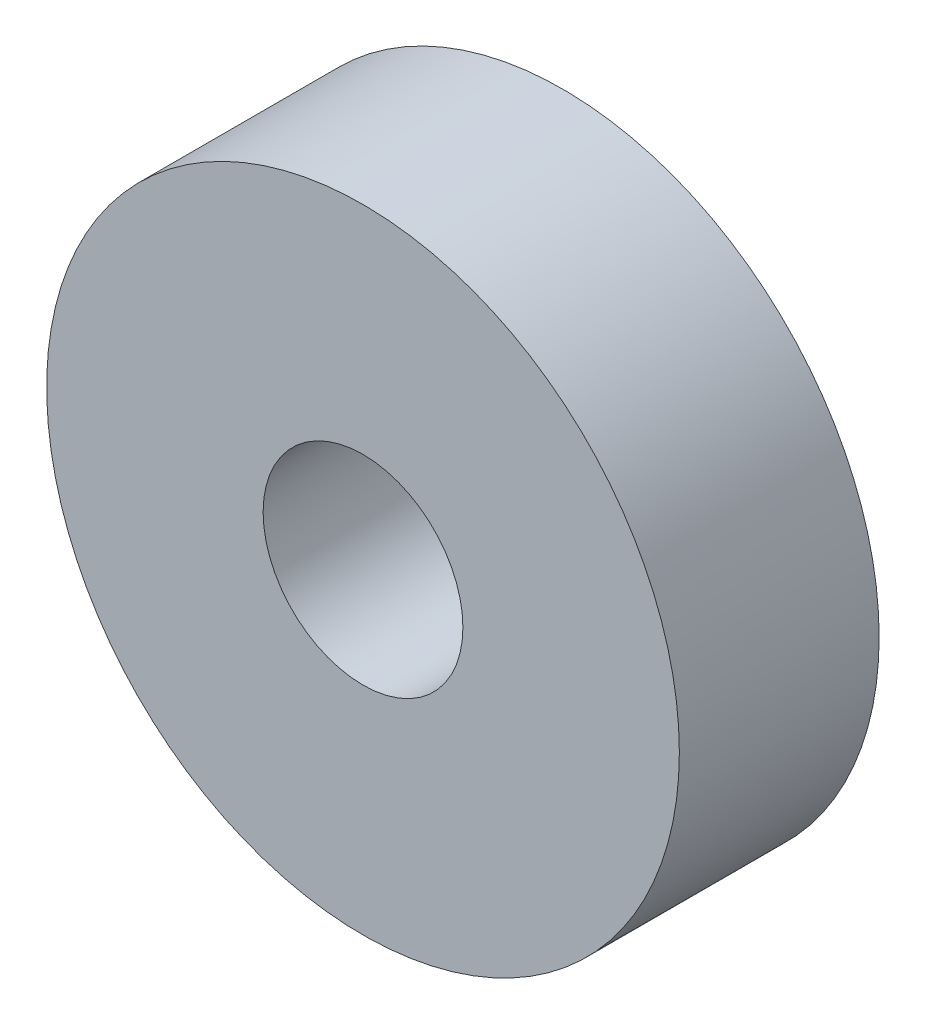
ISO-10303-21;
HEADER;
FILE_DESCRIPTION(('STEP AP214'),'2;1');
FILE_NAME('part.step','',(''),(''),'','','');
FILE_SCHEMA(('AUTOMOTIVE_DESIGN { 1 0 10303 214 1 1 1 1 }'));
ENDSEC;
DATA;
#1=APPLICATION_CONTEXT('core data for automotive mechanical design processes');
#2=APPLICATION_PROTOCOL_DEFINITION('international standard','automotive_design',2000,#1);
#3=PRODUCT_CONTEXT('',#1,'mechanical');
#4=PRODUCT('Part','Part','',(#3));
#5=PRODUCT_RELATED_PRODUCT_CATEGORY('part','',(#4));
#6=PRODUCT_DEFINITION_FORMATION('','',#4);
#7=PRODUCT_DEFINITION_CONTEXT('part definition',#1,'design');
#8=PRODUCT_DEFINITION('design','',#6,#7);
#9=PRODUCT_DEFINITION_SHAPE('','',#8);
#10=(LENGTH_UNIT() NAMED_UNIT(*) SI_UNIT(.MILLI.,.METRE.));
#11=(NAMED_UNIT(*) PLANE_ANGLE_UNIT() SI_UNIT($,.RADIAN.));
#12=(NAMED_UNIT(*) SI_UNIT($,.STERADIAN.) SOLID_ANGLE_UNIT());
#13=UNCERTAINTY_MEASURE_WITH_UNIT(LENGTH_MEASURE(1.E-05),#10,'distance_accuracy_value','');
#14=(GEOMETRIC_REPRESENTATION_CONTEXT(3) GLOBAL_UNCERTAINTY_ASSIGNED_CONTEXT((#13)) GLOBAL_UNIT_ASSIGNED_CONTEXT((#10,
#11,#12)) REPRESENTATION_CONTEXT('',''));
#15=CARTESIAN_POINT('',(0.,0.,0.));
#16=DIRECTION('',(0.,0.,1.));
#17=DIRECTION('',(1.,0.,0.));
#18=AXIS2_PLACEMENT_3D('',#15,#16,#17);
#19=CARTESIAN_POINT('',(0.,0.,6.));
#20=DIRECTION('',(0.,0.,1.));
#21=DIRECTION('',(1.,0.,0.));
#22=AXIS2_PLACEMENT_3D('',#19,#20,#21);
#23=PLANE('',#22);
#24=CARTESIAN_POINT('',(0.,0.,6.));
#25=DIRECTION('',(0.,0.,1.));
#26=DIRECTION('',(1.,0.,0.));
#27=AXIS2_PLACEMENT_3D('',#24,#25,#26);
#28=CIRCLE('',#27,9.5);
#29=CARTESIAN_POINT('',(9.5,0.,6.));
#30=VERTEX_POINT('',#29);
#31=EDGE_CURVE('E10',#30,#30,#28,.T.);
#32=ORIENTED_EDGE('',*,*,#31,.T.);
#33=EDGE_LOOP('',(#32));
#34=FACE_BOUND('',#33,.T.);
#35=CARTESIAN_POINT('',(0.,0.,6.));
#36=DIRECTION('',(0.,0.,1.));
#37=DIRECTION('',(1.,0.,0.));
#38=AXIS2_PLACEMENT_3D('',#35,#36,#37);
#39=CIRCLE('',#38,3.);
#40=CARTESIAN_POINT('',(3.,0.,6.));
#41=VERTEX_POINT('',#40);
#42=EDGE_CURVE('E39',#41,#41,#39,.T.);
#43=ORIENTED_EDGE('',*,*,#42,.F.);
#44=EDGE_LOOP('',(#43));
#45=FACE_BOUND('',#44,.T.);
#46=ADVANCED_FACE('F28',(#34,#45),#23,.T.);
#47=CARTESIAN_POINT('',(0.,0.,0.));
#48=DIRECTION('',(0.,0.,1.));
#49=DIRECTION('',(1.,0.,0.));
#50=AXIS2_PLACEMENT_3D('',#47,#48,#49);
#51=PLANE('',#50);
#52=CARTESIAN_POINT('',(0.,0.,0.));
#53=DIRECTION('',(0.,0.,1.));
#54=DIRECTION('',(1.,0.,0.));
#55=AXIS2_PLACEMENT_3D('',#52,#53,#54);
#56=CIRCLE('',#55,9.5);
#57=CARTESIAN_POINT('',(9.5,0.,0.));
#58=VERTEX_POINT('',#57);
#59=EDGE_CURVE('E32',#58,#58,#56,.T.);
#60=ORIENTED_EDGE('',*,*,#59,.F.);
#61=EDGE_LOOP('',(#60));
#62=FACE_BOUND('',#61,.T.);
#63=CARTESIAN_POINT('',(0.,0.,0.));
#64=DIRECTION('',(0.,0.,1.));
#65=DIRECTION('',(1.,0.,0.));
#66=AXIS2_PLACEMENT_3D('',#63,#64,#65);
#67=CIRCLE('',#66,3.);
#68=CARTESIAN_POINT('',(3.,0.,0.));
#69=VERTEX_POINT('',#68);
#70=EDGE_CURVE('E41',#69,#69,#67,.T.);
#71=ORIENTED_EDGE('',*,*,#70,.T.);
#72=EDGE_LOOP('',(#71));
#73=FACE_BOUND('',#72,.T.);
#74=ADVANCED_FACE('F51',(#62,#73),#51,.F.);
#75=CARTESIAN_POINT('',(0.,0.,6.));
#76=DIRECTION('',(0.,0.,-1.));
#77=DIRECTION('',(-1.,0.,0.));
#78=AXIS2_PLACEMENT_3D('',#75,#76,#77);
#79=CYLINDRICAL_SURFACE('',#78,9.5);
#80=ORIENTED_EDGE('',*,*,#31,.F.);
#81=EDGE_LOOP('',(#80));
#82=FACE_BOUND('',#81,.T.);
#83=ORIENTED_EDGE('',*,*,#59,.T.);
#84=EDGE_LOOP('',(#83));
#85=FACE_BOUND('',#84,.T.);
#86=ADVANCED_FACE('F30',(#82,#85),#79,.T.);
#87=CARTESIAN_POINT('',(0.,0.,6.));
#88=DIRECTION('',(0.,0.,-1.));
#89=DIRECTION('',(-1.,0.,0.));
#90=AXIS2_PLACEMENT_3D('',#87,#88,#89);
#91=CYLINDRICAL_SURFACE('',#90,3.);
#92=ORIENTED_EDGE('',*,*,#42,.T.);
#93=EDGE_LOOP('',(#92));
#94=FACE_BOUND('',#93,.T.);
#95=ORIENTED_EDGE('',*,*,#70,.F.);
#96=EDGE_LOOP('',(#95));
#97=FACE_BOUND('',#96,.T.);
#98=ADVANCED_FACE('F47',(#94,#97),#91,.F.);
#99=CLOSED_SHELL('',(#46,#74,#86,#98));
#100=MANIFOLD_SOLID_BREP('B2',#99);
#101=ADVANCED_BREP_SHAPE_REPRESENTATION('',(#18,#100),#14);
#102=SHAPE_DEFINITION_REPRESENTATION(#9,#101);
ENDSEC;
END-ISO-10303-21;
